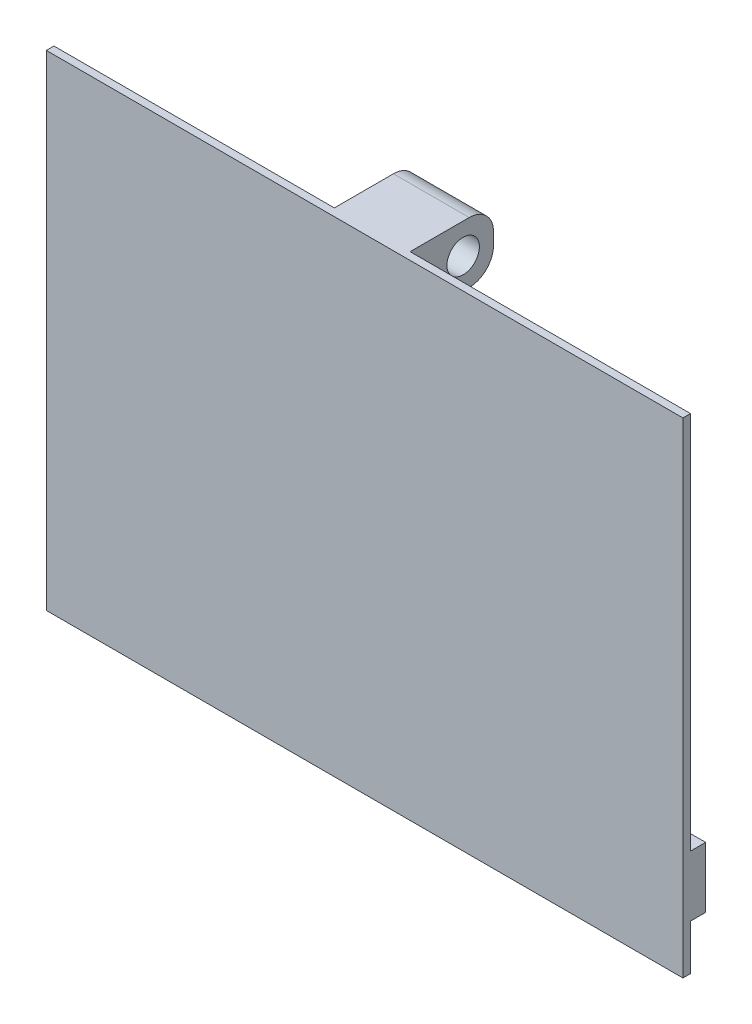
ISO-10303-21;
HEADER;
FILE_DESCRIPTION(('STEP AP214'),'2;1');
FILE_NAME('part.step','',(''),(''),'','','');
FILE_SCHEMA(('AUTOMOTIVE_DESIGN { 1 0 10303 214 1 1 1 1 }'));
ENDSEC;
DATA;
#1=APPLICATION_CONTEXT('core data for automotive mechanical design processes');
#2=APPLICATION_PROTOCOL_DEFINITION('international standard','automotive_design',2000,#1);
#3=PRODUCT_CONTEXT('',#1,'mechanical');
#4=PRODUCT('Part','Part','',(#3));
#5=PRODUCT_RELATED_PRODUCT_CATEGORY('part','',(#4));
#6=PRODUCT_DEFINITION_FORMATION('','',#4);
#7=PRODUCT_DEFINITION_CONTEXT('part definition',#1,'design');
#8=PRODUCT_DEFINITION('design','',#6,#7);
#9=PRODUCT_DEFINITION_SHAPE('','',#8);
#10=(LENGTH_UNIT() NAMED_UNIT(*) SI_UNIT(.MILLI.,.METRE.));
#11=(NAMED_UNIT(*) PLANE_ANGLE_UNIT() SI_UNIT($,.RADIAN.));
#12=(NAMED_UNIT(*) SI_UNIT($,.STERADIAN.) SOLID_ANGLE_UNIT());
#13=UNCERTAINTY_MEASURE_WITH_UNIT(LENGTH_MEASURE(1.E-05),#10,'distance_accuracy_value','');
#14=(GEOMETRIC_REPRESENTATION_CONTEXT(3) GLOBAL_UNCERTAINTY_ASSIGNED_CONTEXT((#13)) GLOBAL_UNIT_ASSIGNED_CONTEXT((#10,
#11,#12)) REPRESENTATION_CONTEXT('',''));
#15=CARTESIAN_POINT('',(0.,0.,0.));
#16=DIRECTION('',(0.,0.,1.));
#17=DIRECTION('',(1.,0.,0.));
#18=AXIS2_PLACEMENT_3D('',#15,#16,#17);
#19=CARTESIAN_POINT('',(0.,0.,0.));
#20=DIRECTION('',(0.,0.,-1.));
#21=DIRECTION('',(-1.,0.,0.));
#22=AXIS2_PLACEMENT_3D('',#19,#20,#21);
#23=PLANE('',#22);
#24=DIRECTION('',(0.,-1.,0.));
#25=VECTOR('',#24,1.);
#26=CARTESIAN_POINT('',(-33.3375,-25.4,0.));
#27=LINE('',#26,#25);
#28=CARTESIAN_POINT('',(-33.3375,-20.6375,0.));
#29=VERTEX_POINT('',#28);
#30=CARTESIAN_POINT('',(-33.3375,-25.4,0.));
#31=VERTEX_POINT('',#30);
#32=EDGE_CURVE('E258',#29,#31,#27,.T.);
#33=ORIENTED_EDGE('',*,*,#32,.F.);
#34=DIRECTION('',(-1.,0.,0.));
#35=VECTOR('',#34,1.);
#36=CARTESIAN_POINT('',(33.3375,-20.6375,0.));
#37=LINE('',#36,#35);
#38=CARTESIAN_POINT('',(33.3375,-20.6375,0.));
#39=VERTEX_POINT('',#38);
#40=EDGE_CURVE('E286',#39,#29,#37,.T.);
#41=ORIENTED_EDGE('',*,*,#40,.F.);
#42=DIRECTION('',(0.,1.,0.));
#43=VECTOR('',#42,1.);
#44=CARTESIAN_POINT('',(33.3375,-25.4,0.));
#45=LINE('',#44,#43);
#46=CARTESIAN_POINT('',(33.3375,-25.4,0.));
#47=VERTEX_POINT('',#46);
#48=EDGE_CURVE('E165',#47,#39,#45,.T.);
#49=ORIENTED_EDGE('',*,*,#48,.F.);
#50=DIRECTION('',(1.,0.,0.));
#51=VECTOR('',#50,1.);
#52=CARTESIAN_POINT('',(-33.3375,-25.4,0.));
#53=LINE('',#52,#51);
#54=EDGE_CURVE('E241',#31,#47,#53,.T.);
#55=ORIENTED_EDGE('',*,*,#54,.F.);
#56=EDGE_LOOP('',(#33,#41,#49,#55));
#57=FACE_BOUND('',#56,.T.);
#58=ADVANCED_FACE('F39',(#57),#23,.T.);
#59=CARTESIAN_POINT('',(33.3375,-14.2875,0.));
#60=VERTEX_POINT('',#59);
#61=CARTESIAN_POINT('',(33.3375,25.4,0.));
#62=VERTEX_POINT('',#61);
#63=EDGE_CURVE('E235',#60,#62,#45,.T.);
#64=ORIENTED_EDGE('',*,*,#63,.F.);
#65=DIRECTION('',(1.,0.,0.));
#66=VECTOR('',#65,1.);
#67=CARTESIAN_POINT('',(33.3375,-14.2875,0.));
#68=LINE('',#67,#66);
#69=CARTESIAN_POINT('',(-33.3375,-14.2875,0.));
#70=VERTEX_POINT('',#69);
#71=EDGE_CURVE('E160',#70,#60,#68,.T.);
#72=ORIENTED_EDGE('',*,*,#71,.F.);
#73=CARTESIAN_POINT('',(-33.3375,25.4,0.));
#74=VERTEX_POINT('',#73);
#75=EDGE_CURVE('E259',#74,#70,#27,.T.);
#76=ORIENTED_EDGE('',*,*,#75,.F.);
#77=DIRECTION('',(-1.,0.,0.));
#78=VECTOR('',#77,1.);
#79=CARTESIAN_POINT('',(-33.3375,25.4,0.));
#80=LINE('',#79,#78);
#81=CARTESIAN_POINT('',(-3.96875,25.4,0.));
#82=VERTEX_POINT('',#81);
#83=EDGE_CURVE('E253',#82,#74,#80,.T.);
#84=ORIENTED_EDGE('',*,*,#83,.F.);
#85=DIRECTION('',(0.,-1.,0.));
#86=VECTOR('',#85,1.);
#87=CARTESIAN_POINT('',(-3.96875,25.4,0.));
#88=LINE('',#87,#86);
#89=CARTESIAN_POINT('',(-3.96875,19.05,0.));
#90=VERTEX_POINT('',#89);
#91=EDGE_CURVE('E64',#82,#90,#88,.T.);
#92=ORIENTED_EDGE('',*,*,#91,.T.);
#93=DIRECTION('',(-1.,0.,0.));
#94=VECTOR('',#93,1.);
#95=CARTESIAN_POINT('',(3.96875,19.05,0.));
#96=LINE('',#95,#94);
#97=CARTESIAN_POINT('',(3.96875,19.05,0.));
#98=VERTEX_POINT('',#97);
#99=EDGE_CURVE('E231',#98,#90,#96,.T.);
#100=ORIENTED_EDGE('',*,*,#99,.F.);
#101=DIRECTION('',(0.,-1.,0.));
#102=VECTOR('',#101,1.);
#103=CARTESIAN_POINT('',(3.96875,25.4,0.));
#104=LINE('',#103,#102);
#105=CARTESIAN_POINT('',(3.96875,25.4,0.));
#106=VERTEX_POINT('',#105);
#107=EDGE_CURVE('E177',#106,#98,#104,.T.);
#108=ORIENTED_EDGE('',*,*,#107,.F.);
#109=EDGE_CURVE('E254',#62,#106,#80,.T.);
#110=ORIENTED_EDGE('',*,*,#109,.F.);
#111=EDGE_LOOP('',(#64,#72,#76,#84,#92,#100,#108,#110));
#112=FACE_BOUND('',#111,.T.);
#113=ADVANCED_FACE('F282',(#112),#23,.T.);
#114=CARTESIAN_POINT('',(33.3375,-25.4,0.79375));
#115=DIRECTION('',(-1.,0.,0.));
#116=DIRECTION('',(0.,0.,1.));
#117=AXIS2_PLACEMENT_3D('',#114,#115,#116);
#118=PLANE('',#117);
#119=ORIENTED_EDGE('',*,*,#48,.T.);
#120=DIRECTION('',(0.,0.,1.));
#121=VECTOR('',#120,1.);
#122=CARTESIAN_POINT('',(33.3375,-20.6375,-1.5875));
#123=LINE('',#122,#121);
#124=CARTESIAN_POINT('',(33.3375,-20.6375,-1.5875));
#125=VERTEX_POINT('',#124);
#126=EDGE_CURVE('E145',#125,#39,#123,.T.);
#127=ORIENTED_EDGE('',*,*,#126,.F.);
#128=DIRECTION('',(0.,-1.,0.));
#129=VECTOR('',#128,1.);
#130=CARTESIAN_POINT('',(33.3375,-14.2875,-1.5875));
#131=LINE('',#130,#129);
#132=CARTESIAN_POINT('',(33.3375,-14.2875,-1.5875));
#133=VERTEX_POINT('',#132);
#134=EDGE_CURVE('E150',#133,#125,#131,.T.);
#135=ORIENTED_EDGE('',*,*,#134,.F.);
#136=DIRECTION('',(0.,0.,1.));
#137=VECTOR('',#136,1.);
#138=CARTESIAN_POINT('',(33.3375,-14.2875,-1.5875));
#139=LINE('',#138,#137);
#140=EDGE_CURVE('E292',#133,#60,#139,.T.);
#141=ORIENTED_EDGE('',*,*,#140,.T.);
#142=ORIENTED_EDGE('',*,*,#63,.T.);
#143=DIRECTION('',(0.,0.,-1.));
#144=VECTOR('',#143,1.);
#145=CARTESIAN_POINT('',(33.3375,25.4,0.79375));
#146=LINE('',#145,#144);
#147=CARTESIAN_POINT('',(33.3375,25.4,0.79375));
#148=VERTEX_POINT('',#147);
#149=EDGE_CURVE('E11',#148,#62,#146,.T.);
#150=ORIENTED_EDGE('',*,*,#149,.F.);
#151=DIRECTION('',(0.,1.,0.));
#152=VECTOR('',#151,1.);
#153=CARTESIAN_POINT('',(33.3375,-25.4,0.79375));
#154=LINE('',#153,#152);
#155=CARTESIAN_POINT('',(33.3375,-25.4,0.79375));
#156=VERTEX_POINT('',#155);
#157=EDGE_CURVE('E236',#156,#148,#154,.T.);
#158=ORIENTED_EDGE('',*,*,#157,.F.);
#159=DIRECTION('',(0.,0.,-1.));
#160=VECTOR('',#159,1.);
#161=CARTESIAN_POINT('',(33.3375,-25.4,0.79375));
#162=LINE('',#161,#160);
#163=EDGE_CURVE('E250',#156,#47,#162,.T.);
#164=ORIENTED_EDGE('',*,*,#163,.T.);
#165=EDGE_LOOP('',(#119,#127,#135,#141,#142,#150,#158,#164));
#166=FACE_BOUND('',#165,.T.);
#167=ADVANCED_FACE('F41',(#166),#118,.F.);
#168=CARTESIAN_POINT('',(-33.3375,25.4,0.79375));
#169=DIRECTION('',(0.,-1.,0.));
#170=DIRECTION('',(0.,0.,-1.));
#171=AXIS2_PLACEMENT_3D('',#168,#169,#170);
#172=PLANE('',#171);
#173=ORIENTED_EDGE('',*,*,#109,.T.);
#174=DIRECTION('',(0.,0.,1.));
#175=VECTOR('',#174,1.);
#176=CARTESIAN_POINT('',(3.96875,25.4,0.));
#177=LINE('',#176,#175);
#178=CARTESIAN_POINT('',(3.96875,25.4,-6.19124999999998));
#179=VERTEX_POINT('',#178);
#180=EDGE_CURVE('E194',#179,#106,#177,.T.);
#181=ORIENTED_EDGE('',*,*,#180,.F.);
#182=DIRECTION('',(-1.,0.,0.));
#183=VECTOR('',#182,1.);
#184=CARTESIAN_POINT('',(3.96875,25.4,-6.19124999999998));
#185=LINE('',#184,#183);
#186=CARTESIAN_POINT('',(-3.96875,25.4,-6.19124999999998));
#187=VERTEX_POINT('',#186);
#188=EDGE_CURVE('E198',#179,#187,#185,.T.);
#189=ORIENTED_EDGE('',*,*,#188,.T.);
#190=DIRECTION('',(0.,0.,1.));
#191=VECTOR('',#190,1.);
#192=CARTESIAN_POINT('',(-3.96875,25.4,0.));
#193=LINE('',#192,#191);
#194=EDGE_CURVE('E182',#187,#82,#193,.T.);
#195=ORIENTED_EDGE('',*,*,#194,.T.);
#196=ORIENTED_EDGE('',*,*,#83,.T.);
#197=DIRECTION('',(0.,0.,-1.));
#198=VECTOR('',#197,1.);
#199=CARTESIAN_POINT('',(-33.3375,25.4,0.79375));
#200=LINE('',#199,#198);
#201=CARTESIAN_POINT('',(-33.3375,25.4,0.79375));
#202=VERTEX_POINT('',#201);
#203=EDGE_CURVE('E49',#202,#74,#200,.T.);
#204=ORIENTED_EDGE('',*,*,#203,.F.);
#205=DIRECTION('',(-1.,0.,0.));
#206=VECTOR('',#205,1.);
#207=CARTESIAN_POINT('',(-33.3375,25.4,0.79375));
#208=LINE('',#207,#206);
#209=EDGE_CURVE('E240',#148,#202,#208,.T.);
#210=ORIENTED_EDGE('',*,*,#209,.F.);
#211=ORIENTED_EDGE('',*,*,#149,.T.);
#212=EDGE_LOOP('',(#173,#181,#189,#195,#196,#204,#210,#211));
#213=FACE_BOUND('',#212,.T.);
#214=ADVANCED_FACE('F303',(#213),#172,.F.);
#215=CARTESIAN_POINT('',(-33.3375,-25.4,0.79375));
#216=DIRECTION('',(1.,0.,0.));
#217=DIRECTION('',(0.,0.,-1.));
#218=AXIS2_PLACEMENT_3D('',#215,#216,#217);
#219=PLANE('',#218);
#220=ORIENTED_EDGE('',*,*,#75,.T.);
#221=DIRECTION('',(0.,0.,1.));
#222=VECTOR('',#221,1.);
#223=CARTESIAN_POINT('',(-33.3375,-14.2875,-1.5875));
#224=LINE('',#223,#222);
#225=CARTESIAN_POINT('',(-33.3375,-14.2875,-1.5875));
#226=VERTEX_POINT('',#225);
#227=EDGE_CURVE('E173',#226,#70,#224,.T.);
#228=ORIENTED_EDGE('',*,*,#227,.F.);
#229=DIRECTION('',(0.,1.,0.));
#230=VECTOR('',#229,1.);
#231=CARTESIAN_POINT('',(-33.3375,-14.2875,-1.5875));
#232=LINE('',#231,#230);
#233=CARTESIAN_POINT('',(-33.3375,-20.6375,-1.5875));
#234=VERTEX_POINT('',#233);
#235=EDGE_CURVE('E149',#234,#226,#232,.T.);
#236=ORIENTED_EDGE('',*,*,#235,.F.);
#237=DIRECTION('',(0.,0.,1.));
#238=VECTOR('',#237,1.);
#239=CARTESIAN_POINT('',(-33.3375,-20.6375,-1.5875));
#240=LINE('',#239,#238);
#241=EDGE_CURVE('E56',#234,#29,#240,.T.);
#242=ORIENTED_EDGE('',*,*,#241,.T.);
#243=ORIENTED_EDGE('',*,*,#32,.T.);
#244=DIRECTION('',(0.,0.,-1.));
#245=VECTOR('',#244,1.);
#246=CARTESIAN_POINT('',(-33.3375,-25.4,0.79375));
#247=LINE('',#246,#245);
#248=CARTESIAN_POINT('',(-33.3375,-25.4,0.79375));
#249=VERTEX_POINT('',#248);
#250=EDGE_CURVE('E267',#249,#31,#247,.T.);
#251=ORIENTED_EDGE('',*,*,#250,.F.);
#252=DIRECTION('',(0.,-1.,0.));
#253=VECTOR('',#252,1.);
#254=CARTESIAN_POINT('',(-33.3375,-25.4,0.79375));
#255=LINE('',#254,#253);
#256=EDGE_CURVE('E244',#202,#249,#255,.T.);
#257=ORIENTED_EDGE('',*,*,#256,.F.);
#258=ORIENTED_EDGE('',*,*,#203,.T.);
#259=EDGE_LOOP('',(#220,#228,#236,#242,#243,#251,#257,#258));
#260=FACE_BOUND('',#259,.T.);
#261=ADVANCED_FACE('F276',(#260),#219,.F.);
#262=CARTESIAN_POINT('',(-33.3375,-25.4,0.79375));
#263=DIRECTION('',(0.,1.,0.));
#264=DIRECTION('',(0.,0.,1.));
#265=AXIS2_PLACEMENT_3D('',#262,#263,#264);
#266=PLANE('',#265);
#267=ORIENTED_EDGE('',*,*,#54,.T.);
#268=ORIENTED_EDGE('',*,*,#163,.F.);
#269=DIRECTION('',(1.,0.,0.));
#270=VECTOR('',#269,1.);
#271=CARTESIAN_POINT('',(-33.3375,-25.4,0.79375));
#272=LINE('',#271,#270);
#273=EDGE_CURVE('E247',#249,#156,#272,.T.);
#274=ORIENTED_EDGE('',*,*,#273,.F.);
#275=ORIENTED_EDGE('',*,*,#250,.T.);
#276=EDGE_LOOP('',(#267,#268,#274,#275));
#277=FACE_BOUND('',#276,.T.);
#278=ADVANCED_FACE('F367',(#277),#266,.F.);
#279=CARTESIAN_POINT('',(0.,0.,0.79375));
#280=DIRECTION('',(0.,0.,-1.));
#281=DIRECTION('',(-1.,0.,0.));
#282=AXIS2_PLACEMENT_3D('',#279,#280,#281);
#283=PLANE('',#282);
#284=ORIENTED_EDGE('',*,*,#157,.T.);
#285=ORIENTED_EDGE('',*,*,#209,.T.);
#286=ORIENTED_EDGE('',*,*,#256,.T.);
#287=ORIENTED_EDGE('',*,*,#273,.T.);
#288=EDGE_LOOP('',(#284,#285,#286,#287));
#289=FACE_BOUND('',#288,.T.);
#290=ADVANCED_FACE('F305',(#289),#283,.F.);
#291=CARTESIAN_POINT('',(3.96875,19.05,0.));
#292=DIRECTION('',(0.,1.,0.));
#293=DIRECTION('',(0.,0.,1.));
#294=AXIS2_PLACEMENT_3D('',#291,#292,#293);
#295=PLANE('',#294);
#296=DIRECTION('',(0.,0.,-1.));
#297=VECTOR('',#296,1.);
#298=CARTESIAN_POINT('',(-3.96875,19.05,0.));
#299=LINE('',#298,#297);
#300=CARTESIAN_POINT('',(-3.96875,19.05,-6.19124999999998));
#301=VERTEX_POINT('',#300);
#302=EDGE_CURVE('E201',#90,#301,#299,.T.);
#303=ORIENTED_EDGE('',*,*,#302,.T.);
#304=DIRECTION('',(-1.,0.,0.));
#305=VECTOR('',#304,1.);
#306=CARTESIAN_POINT('',(3.96875,19.05,-6.19124999999998));
#307=LINE('',#306,#305);
#308=CARTESIAN_POINT('',(3.96875,19.05,-6.19124999999998));
#309=VERTEX_POINT('',#308);
#310=EDGE_CURVE('E227',#309,#301,#307,.T.);
#311=ORIENTED_EDGE('',*,*,#310,.F.);
#312=DIRECTION('',(0.,0.,-1.));
#313=VECTOR('',#312,1.);
#314=CARTESIAN_POINT('',(3.96875,19.05,0.));
#315=LINE('',#314,#313);
#316=EDGE_CURVE('E181',#98,#309,#315,.T.);
#317=ORIENTED_EDGE('',*,*,#316,.F.);
#318=ORIENTED_EDGE('',*,*,#99,.T.);
#319=EDGE_LOOP('',(#303,#311,#317,#318));
#320=FACE_BOUND('',#319,.T.);
#321=ADVANCED_FACE('F342',(#320),#295,.F.);
#322=CARTESIAN_POINT('',(3.96875,21.59,-6.19125));
#323=DIRECTION('',(-1.,0.,0.));
#324=DIRECTION('',(0.,0.,1.));
#325=AXIS2_PLACEMENT_3D('',#322,#323,#324);
#326=CYLINDRICAL_SURFACE('',#325,2.54);
#327=CARTESIAN_POINT('',(-3.96875,21.59,-6.19125));
#328=DIRECTION('',(1.,0.,0.));
#329=DIRECTION('',(0.,0.,-1.));
#330=AXIS2_PLACEMENT_3D('',#327,#328,#329);
#331=CIRCLE('',#330,2.54);
#332=CARTESIAN_POINT('',(-3.96875,21.59,-8.73125));
#333=VERTEX_POINT('',#332);
#334=EDGE_CURVE('E204',#301,#333,#331,.T.);
#335=ORIENTED_EDGE('',*,*,#334,.T.);
#336=DIRECTION('',(-1.,0.,0.));
#337=VECTOR('',#336,1.);
#338=CARTESIAN_POINT('',(3.96875,21.59,-8.73125));
#339=LINE('',#338,#337);
#340=CARTESIAN_POINT('',(3.96875,21.59,-8.73125));
#341=VERTEX_POINT('',#340);
#342=EDGE_CURVE('E223',#341,#333,#339,.T.);
#343=ORIENTED_EDGE('',*,*,#342,.F.);
#344=CARTESIAN_POINT('',(3.96875,21.59,-6.19125));
#345=DIRECTION('',(1.,0.,0.));
#346=DIRECTION('',(0.,0.,-1.));
#347=AXIS2_PLACEMENT_3D('',#344,#345,#346);
#348=CIRCLE('',#347,2.54);
#349=EDGE_CURVE('E185',#309,#341,#348,.T.);
#350=ORIENTED_EDGE('',*,*,#349,.F.);
#351=ORIENTED_EDGE('',*,*,#310,.T.);
#352=EDGE_LOOP('',(#335,#343,#350,#351));
#353=FACE_BOUND('',#352,.T.);
#354=ADVANCED_FACE('F346',(#353),#326,.T.);
#355=CARTESIAN_POINT('',(3.96875,22.86,-8.73125));
#356=DIRECTION('',(0.,0.,1.));
#357=DIRECTION('',(1.,0.,0.));
#358=AXIS2_PLACEMENT_3D('',#355,#356,#357);
#359=PLANE('',#358);
#360=DIRECTION('',(0.,1.,0.));
#361=VECTOR('',#360,1.);
#362=CARTESIAN_POINT('',(-3.96875,22.86,-8.73125));
#363=LINE('',#362,#361);
#364=CARTESIAN_POINT('',(-3.96875,22.86,-8.73125));
#365=VERTEX_POINT('',#364);
#366=EDGE_CURVE('E207',#333,#365,#363,.T.);
#367=ORIENTED_EDGE('',*,*,#366,.T.);
#368=DIRECTION('',(-1.,0.,0.));
#369=VECTOR('',#368,1.);
#370=CARTESIAN_POINT('',(3.96875,22.86,-8.73125));
#371=LINE('',#370,#369);
#372=CARTESIAN_POINT('',(3.96875,22.86,-8.73125));
#373=VERTEX_POINT('',#372);
#374=EDGE_CURVE('E219',#373,#365,#371,.T.);
#375=ORIENTED_EDGE('',*,*,#374,.F.);
#376=DIRECTION('',(0.,1.,0.));
#377=VECTOR('',#376,1.);
#378=CARTESIAN_POINT('',(3.96875,22.86,-8.73125));
#379=LINE('',#378,#377);
#380=EDGE_CURVE('E188',#341,#373,#379,.T.);
#381=ORIENTED_EDGE('',*,*,#380,.F.);
#382=ORIENTED_EDGE('',*,*,#342,.T.);
#383=EDGE_LOOP('',(#367,#375,#381,#382));
#384=FACE_BOUND('',#383,.T.);
#385=ADVANCED_FACE('F350',(#384),#359,.F.);
#386=CARTESIAN_POINT('',(3.96875,22.86,-6.19125));
#387=DIRECTION('',(-1.,0.,0.));
#388=DIRECTION('',(0.,0.,1.));
#389=AXIS2_PLACEMENT_3D('',#386,#387,#388);
#390=CYLINDRICAL_SURFACE('',#389,2.54);
#391=CARTESIAN_POINT('',(-3.96875,22.86,-6.19125));
#392=DIRECTION('',(1.,0.,0.));
#393=DIRECTION('',(0.,0.,1.));
#394=AXIS2_PLACEMENT_3D('',#391,#392,#393);
#395=CIRCLE('',#394,2.54);
#396=EDGE_CURVE('E210',#365,#187,#395,.T.);
#397=ORIENTED_EDGE('',*,*,#396,.T.);
#398=ORIENTED_EDGE('',*,*,#188,.F.);
#399=CARTESIAN_POINT('',(3.96875,22.86,-6.19125));
#400=DIRECTION('',(1.,0.,0.));
#401=DIRECTION('',(0.,0.,1.));
#402=AXIS2_PLACEMENT_3D('',#399,#400,#401);
#403=CIRCLE('',#402,2.54);
#404=EDGE_CURVE('E191',#373,#179,#403,.T.);
#405=ORIENTED_EDGE('',*,*,#404,.F.);
#406=ORIENTED_EDGE('',*,*,#374,.T.);
#407=EDGE_LOOP('',(#397,#398,#405,#406));
#408=FACE_BOUND('',#407,.T.);
#409=ADVANCED_FACE('F330',(#408),#390,.T.);
#410=CARTESIAN_POINT('',(3.96875,21.59,-6.19125));
#411=DIRECTION('',(1.,0.,0.));
#412=DIRECTION('',(0.,0.,-1.));
#413=AXIS2_PLACEMENT_3D('',#410,#411,#412);
#414=PLANE('',#413);
#415=CARTESIAN_POINT('',(3.96875,22.225,-5.55625));
#416=DIRECTION('',(1.,0.,0.));
#417=DIRECTION('',(0.,0.,-1.));
#418=AXIS2_PLACEMENT_3D('',#415,#416,#417);
#419=CIRCLE('',#418,1.69999999999999);
#420=CARTESIAN_POINT('',(3.96875,22.225,-7.25624999999999));
#421=VERTEX_POINT('',#420);
#422=EDGE_CURVE('E167',#421,#421,#419,.T.);
#423=ORIENTED_EDGE('',*,*,#422,.F.);
#424=EDGE_LOOP('',(#423));
#425=FACE_BOUND('',#424,.T.);
#426=ORIENTED_EDGE('',*,*,#107,.T.);
#427=ORIENTED_EDGE('',*,*,#316,.T.);
#428=ORIENTED_EDGE('',*,*,#349,.T.);
#429=ORIENTED_EDGE('',*,*,#380,.T.);
#430=ORIENTED_EDGE('',*,*,#404,.T.);
#431=ORIENTED_EDGE('',*,*,#180,.T.);
#432=EDGE_LOOP('',(#426,#427,#428,#429,#430,#431));
#433=FACE_BOUND('',#432,.T.);
#434=ADVANCED_FACE('F327',(#425,#433),#414,.T.);
#435=CARTESIAN_POINT('',(-3.96875,21.59,-6.19125));
#436=DIRECTION('',(1.,0.,0.));
#437=DIRECTION('',(0.,0.,-1.));
#438=AXIS2_PLACEMENT_3D('',#435,#436,#437);
#439=PLANE('',#438);
#440=CARTESIAN_POINT('',(-3.96875,22.225,-5.55625));
#441=DIRECTION('',(1.,0.,0.));
#442=DIRECTION('',(0.,0.,-1.));
#443=AXIS2_PLACEMENT_3D('',#440,#441,#442);
#444=CIRCLE('',#443,1.69999999999999);
#445=CARTESIAN_POINT('',(-3.96875,22.225,-7.25624999999999));
#446=VERTEX_POINT('',#445);
#447=EDGE_CURVE('E43',#446,#446,#444,.T.);
#448=ORIENTED_EDGE('',*,*,#447,.T.);
#449=EDGE_LOOP('',(#448));
#450=FACE_BOUND('',#449,.T.);
#451=ORIENTED_EDGE('',*,*,#91,.F.);
#452=ORIENTED_EDGE('',*,*,#194,.F.);
#453=ORIENTED_EDGE('',*,*,#396,.F.);
#454=ORIENTED_EDGE('',*,*,#366,.F.);
#455=ORIENTED_EDGE('',*,*,#334,.F.);
#456=ORIENTED_EDGE('',*,*,#302,.F.);
#457=EDGE_LOOP('',(#451,#452,#453,#454,#455,#456));
#458=FACE_BOUND('',#457,.T.);
#459=ADVANCED_FACE('F318',(#450,#458),#439,.F.);
#460=CARTESIAN_POINT('',(0.,22.225,-5.55625));
#461=DIRECTION('',(1.,0.,0.));
#462=DIRECTION('',(0.,0.,-1.));
#463=AXIS2_PLACEMENT_3D('',#460,#461,#462);
#464=CYLINDRICAL_SURFACE('',#463,1.69999999999999);
#465=ORIENTED_EDGE('',*,*,#447,.F.);
#466=EDGE_LOOP('',(#465));
#467=FACE_BOUND('',#466,.T.);
#468=ORIENTED_EDGE('',*,*,#422,.T.);
#469=EDGE_LOOP('',(#468));
#470=FACE_BOUND('',#469,.T.);
#471=ADVANCED_FACE('F321',(#467,#470),#464,.F.);
#472=CARTESIAN_POINT('',(33.3375,-20.6375,-1.5875));
#473=DIRECTION('',(0.,1.,0.));
#474=DIRECTION('',(-1.,0.,0.));
#475=AXIS2_PLACEMENT_3D('',#472,#473,#474);
#476=PLANE('',#475);
#477=ORIENTED_EDGE('',*,*,#40,.T.);
#478=ORIENTED_EDGE('',*,*,#241,.F.);
#479=DIRECTION('',(-1.,0.,0.));
#480=VECTOR('',#479,1.);
#481=CARTESIAN_POINT('',(33.3375,-20.6375,-1.5875));
#482=LINE('',#481,#480);
#483=EDGE_CURVE('E141',#125,#234,#482,.T.);
#484=ORIENTED_EDGE('',*,*,#483,.F.);
#485=ORIENTED_EDGE('',*,*,#126,.T.);
#486=EDGE_LOOP('',(#477,#478,#484,#485));
#487=FACE_BOUND('',#486,.T.);
#488=ADVANCED_FACE('F143',(#487),#476,.F.);
#489=CARTESIAN_POINT('',(33.3375,-14.2875,-1.5875));
#490=DIRECTION('',(0.,-1.,0.));
#491=DIRECTION('',(0.,0.,-1.));
#492=AXIS2_PLACEMENT_3D('',#489,#490,#491);
#493=PLANE('',#492);
#494=ORIENTED_EDGE('',*,*,#71,.T.);
#495=ORIENTED_EDGE('',*,*,#140,.F.);
#496=DIRECTION('',(1.,0.,0.));
#497=VECTOR('',#496,1.);
#498=CARTESIAN_POINT('',(33.3375,-14.2875,-1.5875));
#499=LINE('',#498,#497);
#500=EDGE_CURVE('E155',#226,#133,#499,.T.);
#501=ORIENTED_EDGE('',*,*,#500,.F.);
#502=ORIENTED_EDGE('',*,*,#227,.T.);
#503=EDGE_LOOP('',(#494,#495,#501,#502));
#504=FACE_BOUND('',#503,.T.);
#505=ADVANCED_FACE('F295',(#504),#493,.F.);
#506=CARTESIAN_POINT('',(0.,0.,-1.5875));
#507=DIRECTION('',(0.,0.,-1.));
#508=DIRECTION('',(-1.,0.,0.));
#509=AXIS2_PLACEMENT_3D('',#506,#507,#508);
#510=PLANE('',#509);
#511=ORIENTED_EDGE('',*,*,#134,.T.);
#512=ORIENTED_EDGE('',*,*,#483,.T.);
#513=ORIENTED_EDGE('',*,*,#235,.T.);
#514=ORIENTED_EDGE('',*,*,#500,.T.);
#515=EDGE_LOOP('',(#511,#512,#513,#514));
#516=FACE_BOUND('',#515,.T.);
#517=ADVANCED_FACE('F153',(#516),#510,.T.);
#518=CLOSED_SHELL('',(#58,#113,#167,#214,#261,#278,#290,#321,#354,#385,#409,#434,#459,#471,#488,
#505,#517));
#519=MANIFOLD_SOLID_BREP('B2',#518);
#520=ADVANCED_BREP_SHAPE_REPRESENTATION('',(#18,#519),#14);
#521=SHAPE_DEFINITION_REPRESENTATION(#9,#520);
ENDSEC;
END-ISO-10303-21;
